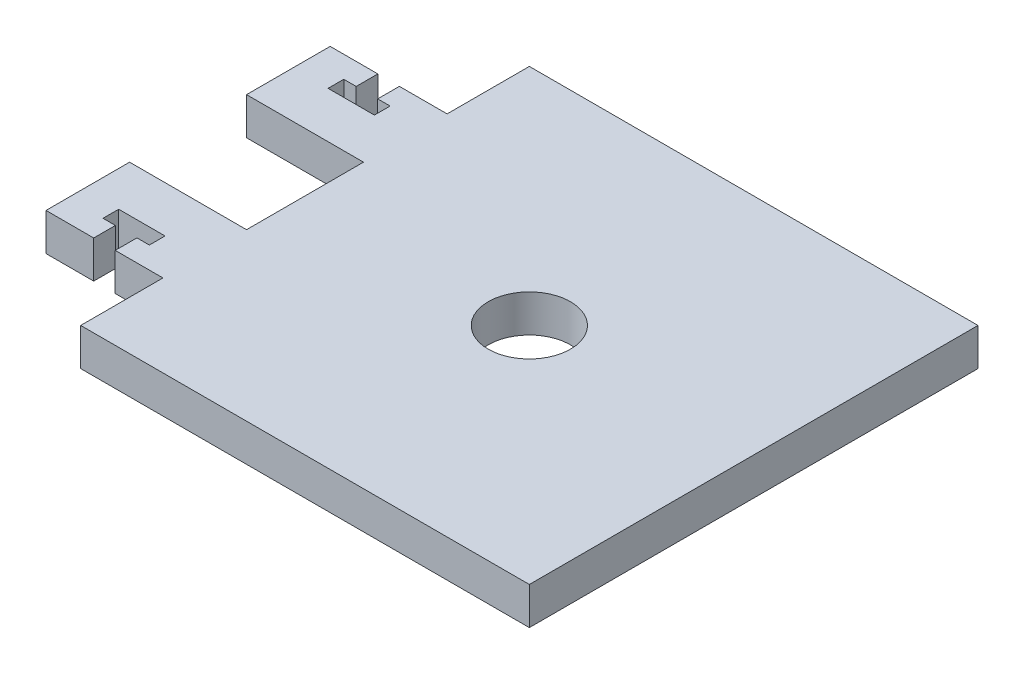
ISO-10303-21;
HEADER;
FILE_DESCRIPTION(('STEP AP214'),'2;1');
FILE_NAME('part.step','',(''),(''),'','','');
FILE_SCHEMA(('AUTOMOTIVE_DESIGN { 1 0 10303 214 1 1 1 1 }'));
ENDSEC;
DATA;
#1=APPLICATION_CONTEXT('core data for automotive mechanical design processes');
#2=APPLICATION_PROTOCOL_DEFINITION('international standard','automotive_design',2000,#1);
#3=PRODUCT_CONTEXT('',#1,'mechanical');
#4=PRODUCT('Part','Part','',(#3));
#5=PRODUCT_RELATED_PRODUCT_CATEGORY('part','',(#4));
#6=PRODUCT_DEFINITION_FORMATION('','',#4);
#7=PRODUCT_DEFINITION_CONTEXT('part definition',#1,'design');
#8=PRODUCT_DEFINITION('design','',#6,#7);
#9=PRODUCT_DEFINITION_SHAPE('','',#8);
#10=(LENGTH_UNIT() NAMED_UNIT(*) SI_UNIT(.MILLI.,.METRE.));
#11=(NAMED_UNIT(*) PLANE_ANGLE_UNIT() SI_UNIT($,.RADIAN.));
#12=(NAMED_UNIT(*) SI_UNIT($,.STERADIAN.) SOLID_ANGLE_UNIT());
#13=UNCERTAINTY_MEASURE_WITH_UNIT(LENGTH_MEASURE(1.E-05),#10,'distance_accuracy_value','');
#14=(GEOMETRIC_REPRESENTATION_CONTEXT(3) GLOBAL_UNCERTAINTY_ASSIGNED_CONTEXT((#13)) GLOBAL_UNIT_ASSIGNED_CONTEXT((#10,
#11,#12)) REPRESENTATION_CONTEXT('',''));
#15=CARTESIAN_POINT('',(0.,0.,0.));
#16=DIRECTION('',(0.,0.,1.));
#17=DIRECTION('',(1.,0.,0.));
#18=AXIS2_PLACEMENT_3D('',#15,#16,#17);
#19=CARTESIAN_POINT('',(38.1000000000002,-6.35,38.1000000000002));
#20=DIRECTION('',(1.,0.,0.));
#21=DIRECTION('',(0.,0.,-1.));
#22=AXIS2_PLACEMENT_3D('',#19,#20,#21);
#23=PLANE('',#22);
#24=DIRECTION('',(0.,0.,-1.));
#25=VECTOR('',#24,1.);
#26=CARTESIAN_POINT('',(38.1000000000002,0.,38.1000000000002));
#27=LINE('',#26,#25);
#28=CARTESIAN_POINT('',(38.1000000000002,0.,38.1000000000002));
#29=VERTEX_POINT('',#28);
#30=CARTESIAN_POINT('',(38.1000000000002,0.,-38.1000000000002));
#31=VERTEX_POINT('',#30);
#32=EDGE_CURVE('E251',#29,#31,#27,.T.);
#33=ORIENTED_EDGE('',*,*,#32,.F.);
#34=DIRECTION('',(0.,1.,0.));
#35=VECTOR('',#34,1.);
#36=CARTESIAN_POINT('',(38.1000000000002,-6.35,38.1000000000002));
#37=LINE('',#36,#35);
#38=CARTESIAN_POINT('',(38.1000000000002,-6.35,38.1000000000002));
#39=VERTEX_POINT('',#38);
#40=EDGE_CURVE('E11',#39,#29,#37,.T.);
#41=ORIENTED_EDGE('',*,*,#40,.F.);
#42=DIRECTION('',(0.,0.,-1.));
#43=VECTOR('',#42,1.);
#44=CARTESIAN_POINT('',(38.1000000000002,-6.35,38.1000000000002));
#45=LINE('',#44,#43);
#46=CARTESIAN_POINT('',(38.1000000000002,-6.35,-38.1000000000002));
#47=VERTEX_POINT('',#46);
#48=EDGE_CURVE('E332',#39,#47,#45,.T.);
#49=ORIENTED_EDGE('',*,*,#48,.T.);
#50=DIRECTION('',(0.,1.,0.));
#51=VECTOR('',#50,1.);
#52=CARTESIAN_POINT('',(38.1000000000002,-6.35,-38.1000000000002));
#53=LINE('',#52,#51);
#54=EDGE_CURVE('E37',#47,#31,#53,.T.);
#55=ORIENTED_EDGE('',*,*,#54,.T.);
#56=EDGE_LOOP('',(#33,#41,#49,#55));
#57=FACE_BOUND('',#56,.T.);
#58=ADVANCED_FACE('F34',(#57),#23,.T.);
#59=CARTESIAN_POINT('',(-38.0999999999998,-6.35,38.1000000000002));
#60=DIRECTION('',(0.,0.,1.));
#61=DIRECTION('',(1.,0.,0.));
#62=AXIS2_PLACEMENT_3D('',#59,#60,#61);
#63=PLANE('',#62);
#64=DIRECTION('',(1.,0.,0.));
#65=VECTOR('',#64,1.);
#66=CARTESIAN_POINT('',(-38.0999999999998,0.,38.1000000000002));
#67=LINE('',#66,#65);
#68=CARTESIAN_POINT('',(-38.0999999999998,0.,38.1000000000002));
#69=VERTEX_POINT('',#68);
#70=EDGE_CURVE('E330',#69,#29,#67,.T.);
#71=ORIENTED_EDGE('',*,*,#70,.F.);
#72=DIRECTION('',(0.,1.,0.));
#73=VECTOR('',#72,1.);
#74=CARTESIAN_POINT('',(-38.0999999999998,-6.35,38.1000000000002));
#75=LINE('',#74,#73);
#76=CARTESIAN_POINT('',(-38.0999999999998,-6.35,38.1000000000002));
#77=VERTEX_POINT('',#76);
#78=EDGE_CURVE('E43',#77,#69,#75,.T.);
#79=ORIENTED_EDGE('',*,*,#78,.F.);
#80=DIRECTION('',(1.,0.,0.));
#81=VECTOR('',#80,1.);
#82=CARTESIAN_POINT('',(-38.0999999999998,-6.35,38.1000000000002));
#83=LINE('',#82,#81);
#84=EDGE_CURVE('E241',#77,#39,#83,.T.);
#85=ORIENTED_EDGE('',*,*,#84,.T.);
#86=ORIENTED_EDGE('',*,*,#40,.T.);
#87=EDGE_LOOP('',(#71,#79,#85,#86));
#88=FACE_BOUND('',#87,.T.);
#89=ADVANCED_FACE('F384',(#88),#63,.T.);
#90=CARTESIAN_POINT('',(-38.0999999999998,-6.35,38.1000000000002));
#91=DIRECTION('',(-1.,0.,0.));
#92=DIRECTION('',(0.,0.,1.));
#93=AXIS2_PLACEMENT_3D('',#90,#91,#92);
#94=PLANE('',#93);
#95=DIRECTION('',(0.,0.,1.));
#96=VECTOR('',#95,1.);
#97=CARTESIAN_POINT('',(-38.0999999999998,0.,38.1000000000002));
#98=LINE('',#97,#96);
#99=CARTESIAN_POINT('',(-38.0999999999998,0.,24.1300000000002));
#100=VERTEX_POINT('',#99);
#101=EDGE_CURVE('E228',#100,#69,#98,.T.);
#102=ORIENTED_EDGE('',*,*,#101,.F.);
#103=DIRECTION('',(0.,1.,0.));
#104=VECTOR('',#103,1.);
#105=CARTESIAN_POINT('',(-38.0999999999998,-6.35,24.1300000000002));
#106=LINE('',#105,#104);
#107=CARTESIAN_POINT('',(-38.0999999999998,-6.35,24.1300000000002));
#108=VERTEX_POINT('',#107);
#109=EDGE_CURVE('E223',#108,#100,#106,.T.);
#110=ORIENTED_EDGE('',*,*,#109,.F.);
#111=DIRECTION('',(0.,0.,1.));
#112=VECTOR('',#111,1.);
#113=CARTESIAN_POINT('',(-38.0999999999998,-6.35,38.1000000000002));
#114=LINE('',#113,#112);
#115=EDGE_CURVE('E226',#108,#77,#114,.T.);
#116=ORIENTED_EDGE('',*,*,#115,.T.);
#117=ORIENTED_EDGE('',*,*,#78,.T.);
#118=EDGE_LOOP('',(#102,#110,#116,#117));
#119=FACE_BOUND('',#118,.T.);
#120=ADVANCED_FACE('F225',(#119),#94,.T.);
#121=CARTESIAN_POINT('',(-38.0999999999998,-6.35,24.1300000000002));
#122=DIRECTION('',(0.,0.,1.));
#123=DIRECTION('',(1.,0.,0.));
#124=AXIS2_PLACEMENT_3D('',#121,#122,#123);
#125=PLANE('',#124);
#126=DIRECTION('',(1.,0.,0.));
#127=VECTOR('',#126,1.);
#128=CARTESIAN_POINT('',(-38.0999999999998,0.,24.1300000000002));
#129=LINE('',#128,#127);
#130=CARTESIAN_POINT('',(-46.2025999999998,0.,24.1300000000001));
#131=VERTEX_POINT('',#130);
#132=EDGE_CURVE('E327',#131,#100,#129,.T.);
#133=ORIENTED_EDGE('',*,*,#132,.F.);
#134=DIRECTION('',(0.,1.,0.));
#135=VECTOR('',#134,1.);
#136=CARTESIAN_POINT('',(-46.2025999999998,-6.35,24.1300000000001));
#137=LINE('',#136,#135);
#138=CARTESIAN_POINT('',(-46.2025999999998,-6.35,24.1300000000001));
#139=VERTEX_POINT('',#138);
#140=EDGE_CURVE('E233',#139,#131,#137,.T.);
#141=ORIENTED_EDGE('',*,*,#140,.F.);
#142=DIRECTION('',(1.,0.,0.));
#143=VECTOR('',#142,1.);
#144=CARTESIAN_POINT('',(-38.0999999999998,-6.35,24.1300000000002));
#145=LINE('',#144,#143);
#146=EDGE_CURVE('E239',#139,#108,#145,.T.);
#147=ORIENTED_EDGE('',*,*,#146,.T.);
#148=ORIENTED_EDGE('',*,*,#109,.T.);
#149=EDGE_LOOP('',(#133,#141,#147,#148));
#150=FACE_BOUND('',#149,.T.);
#151=ADVANCED_FACE('F243',(#150),#125,.T.);
#152=CARTESIAN_POINT('',(-46.2025999999998,-6.35,24.1300000000001));
#153=DIRECTION('',(-1.,0.,0.));
#154=DIRECTION('',(0.,0.,1.));
#155=AXIS2_PLACEMENT_3D('',#152,#153,#154);
#156=PLANE('',#155);
#157=DIRECTION('',(0.,0.,1.));
#158=VECTOR('',#157,1.);
#159=CARTESIAN_POINT('',(-46.2025999999998,0.,24.1300000000001));
#160=LINE('',#159,#158);
#161=CARTESIAN_POINT('',(-46.2025999999998,0.,20.4470000000001));
#162=VERTEX_POINT('',#161);
#163=EDGE_CURVE('E324',#162,#131,#160,.T.);
#164=ORIENTED_EDGE('',*,*,#163,.F.);
#165=DIRECTION('',(0.,1.,0.));
#166=VECTOR('',#165,1.);
#167=CARTESIAN_POINT('',(-46.2025999999998,-6.35,20.4470000000001));
#168=LINE('',#167,#166);
#169=CARTESIAN_POINT('',(-46.2025999999998,-6.35,20.4470000000001));
#170=VERTEX_POINT('',#169);
#171=EDGE_CURVE('E336',#170,#162,#168,.T.);
#172=ORIENTED_EDGE('',*,*,#171,.F.);
#173=DIRECTION('',(0.,0.,1.));
#174=VECTOR('',#173,1.);
#175=CARTESIAN_POINT('',(-46.2025999999998,-6.35,24.1300000000001));
#176=LINE('',#175,#174);
#177=EDGE_CURVE('E244',#170,#139,#176,.T.);
#178=ORIENTED_EDGE('',*,*,#177,.T.);
#179=ORIENTED_EDGE('',*,*,#140,.T.);
#180=EDGE_LOOP('',(#164,#172,#178,#179));
#181=FACE_BOUND('',#180,.T.);
#182=ADVANCED_FACE('F397',(#181),#156,.T.);
#183=CARTESIAN_POINT('',(-46.2025999999998,-6.35,20.4470000000001));
#184=DIRECTION('',(0.,0.,-1.));
#185=DIRECTION('',(-1.,0.,0.));
#186=AXIS2_PLACEMENT_3D('',#183,#184,#185);
#187=PLANE('',#186);
#188=DIRECTION('',(-1.,0.,0.));
#189=VECTOR('',#188,1.);
#190=CARTESIAN_POINT('',(-46.2025999999998,0.,20.4470000000001));
#191=LINE('',#190,#189);
#192=CARTESIAN_POINT('',(-44.0943999999998,0.,20.4470000000001));
#193=VERTEX_POINT('',#192);
#194=EDGE_CURVE('E321',#193,#162,#191,.T.);
#195=ORIENTED_EDGE('',*,*,#194,.F.);
#196=DIRECTION('',(0.,1.,0.));
#197=VECTOR('',#196,1.);
#198=CARTESIAN_POINT('',(-44.0943999999998,-6.35,20.4470000000001));
#199=LINE('',#198,#197);
#200=CARTESIAN_POINT('',(-44.0943999999998,-6.35,20.4470000000001));
#201=VERTEX_POINT('',#200);
#202=EDGE_CURVE('E338',#201,#193,#199,.T.);
#203=ORIENTED_EDGE('',*,*,#202,.F.);
#204=DIRECTION('',(-1.,0.,0.));
#205=VECTOR('',#204,1.);
#206=CARTESIAN_POINT('',(-46.2025999999998,-6.35,20.4470000000001));
#207=LINE('',#206,#205);
#208=EDGE_CURVE('E246',#201,#170,#207,.T.);
#209=ORIENTED_EDGE('',*,*,#208,.T.);
#210=ORIENTED_EDGE('',*,*,#171,.T.);
#211=EDGE_LOOP('',(#195,#203,#209,#210));
#212=FACE_BOUND('',#211,.T.);
#213=ADVANCED_FACE('F400',(#212),#187,.T.);
#214=CARTESIAN_POINT('',(-44.0943999999998,-6.35,20.4470000000001));
#215=DIRECTION('',(-1.,0.,0.));
#216=DIRECTION('',(0.,0.,1.));
#217=AXIS2_PLACEMENT_3D('',#214,#215,#216);
#218=PLANE('',#217);
#219=DIRECTION('',(0.,0.,1.));
#220=VECTOR('',#219,1.);
#221=CARTESIAN_POINT('',(-44.0943999999998,0.,20.4470000000001));
#222=LINE('',#221,#220);
#223=CARTESIAN_POINT('',(-44.0943999999998,0.,17.7800000000002));
#224=VERTEX_POINT('',#223);
#225=EDGE_CURVE('E318',#224,#193,#222,.T.);
#226=ORIENTED_EDGE('',*,*,#225,.F.);
#227=DIRECTION('',(0.,1.,0.));
#228=VECTOR('',#227,1.);
#229=CARTESIAN_POINT('',(-44.0943999999998,-6.35,17.7800000000002));
#230=LINE('',#229,#228);
#231=CARTESIAN_POINT('',(-44.0943999999998,-6.35,17.7800000000002));
#232=VERTEX_POINT('',#231);
#233=EDGE_CURVE('E340',#232,#224,#230,.T.);
#234=ORIENTED_EDGE('',*,*,#233,.F.);
#235=DIRECTION('',(0.,0.,1.));
#236=VECTOR('',#235,1.);
#237=CARTESIAN_POINT('',(-44.0943999999998,-6.35,20.4470000000001));
#238=LINE('',#237,#236);
#239=EDGE_CURVE('E575',#232,#201,#238,.T.);
#240=ORIENTED_EDGE('',*,*,#239,.T.);
#241=ORIENTED_EDGE('',*,*,#202,.T.);
#242=EDGE_LOOP('',(#226,#234,#240,#241));
#243=FACE_BOUND('',#242,.T.);
#244=ADVANCED_FACE('F404',(#243),#218,.T.);
#245=CARTESIAN_POINT('',(-44.0943999999998,-6.35,17.7800000000002));
#246=DIRECTION('',(0.,0.,1.));
#247=DIRECTION('',(1.,0.,0.));
#248=AXIS2_PLACEMENT_3D('',#245,#246,#247);
#249=PLANE('',#248);
#250=DIRECTION('',(1.,0.,0.));
#251=VECTOR('',#250,1.);
#252=CARTESIAN_POINT('',(-44.0943999999998,0.,17.7800000000002));
#253=LINE('',#252,#251);
#254=CARTESIAN_POINT('',(-51.9683999999998,0.,17.7800000000002));
#255=VERTEX_POINT('',#254);
#256=EDGE_CURVE('E315',#255,#224,#253,.T.);
#257=ORIENTED_EDGE('',*,*,#256,.F.);
#258=DIRECTION('',(0.,1.,0.));
#259=VECTOR('',#258,1.);
#260=CARTESIAN_POINT('',(-51.9683999999998,-6.35,17.7800000000002));
#261=LINE('',#260,#259);
#262=CARTESIAN_POINT('',(-51.9683999999998,-6.35,17.7800000000002));
#263=VERTEX_POINT('',#262);
#264=EDGE_CURVE('E342',#263,#255,#261,.T.);
#265=ORIENTED_EDGE('',*,*,#264,.F.);
#266=DIRECTION('',(1.,0.,0.));
#267=VECTOR('',#266,1.);
#268=CARTESIAN_POINT('',(-44.0943999999998,-6.35,17.7800000000002));
#269=LINE('',#268,#267);
#270=EDGE_CURVE('E572',#263,#232,#269,.T.);
#271=ORIENTED_EDGE('',*,*,#270,.T.);
#272=ORIENTED_EDGE('',*,*,#233,.T.);
#273=EDGE_LOOP('',(#257,#265,#271,#272));
#274=FACE_BOUND('',#273,.T.);
#275=ADVANCED_FACE('F408',(#274),#249,.T.);
#276=CARTESIAN_POINT('',(-51.9683999999998,-6.35,20.4470000000001));
#277=DIRECTION('',(1.,0.,0.));
#278=DIRECTION('',(0.,0.,-1.));
#279=AXIS2_PLACEMENT_3D('',#276,#277,#278);
#280=PLANE('',#279);
#281=DIRECTION('',(0.,0.,-1.));
#282=VECTOR('',#281,1.);
#283=CARTESIAN_POINT('',(-51.9683999999998,0.,20.4470000000001));
#284=LINE('',#283,#282);
#285=CARTESIAN_POINT('',(-51.9683999999998,0.,20.4470000000001));
#286=VERTEX_POINT('',#285);
#287=EDGE_CURVE('E312',#286,#255,#284,.T.);
#288=ORIENTED_EDGE('',*,*,#287,.F.);
#289=DIRECTION('',(0.,1.,0.));
#290=VECTOR('',#289,1.);
#291=CARTESIAN_POINT('',(-51.9683999999998,-6.35,20.4470000000001));
#292=LINE('',#291,#290);
#293=CARTESIAN_POINT('',(-51.9683999999998,-6.35,20.4470000000001));
#294=VERTEX_POINT('',#293);
#295=EDGE_CURVE('E344',#294,#286,#292,.T.);
#296=ORIENTED_EDGE('',*,*,#295,.F.);
#297=DIRECTION('',(0.,0.,-1.));
#298=VECTOR('',#297,1.);
#299=CARTESIAN_POINT('',(-51.9683999999998,-6.35,20.4470000000001));
#300=LINE('',#299,#298);
#301=EDGE_CURVE('E569',#294,#263,#300,.T.);
#302=ORIENTED_EDGE('',*,*,#301,.T.);
#303=ORIENTED_EDGE('',*,*,#264,.T.);
#304=EDGE_LOOP('',(#288,#296,#302,#303));
#305=FACE_BOUND('',#304,.T.);
#306=ADVANCED_FACE('F412',(#305),#280,.T.);
#307=CARTESIAN_POINT('',(-49.8601999999998,-6.35,20.4470000000001));
#308=DIRECTION('',(0.,0.,-1.));
#309=DIRECTION('',(-1.,0.,0.));
#310=AXIS2_PLACEMENT_3D('',#307,#308,#309);
#311=PLANE('',#310);
#312=DIRECTION('',(-1.,0.,0.));
#313=VECTOR('',#312,1.);
#314=CARTESIAN_POINT('',(-49.8601999999998,0.,20.4470000000001));
#315=LINE('',#314,#313);
#316=CARTESIAN_POINT('',(-49.8601999999998,0.,20.4470000000001));
#317=VERTEX_POINT('',#316);
#318=EDGE_CURVE('E309',#317,#286,#315,.T.);
#319=ORIENTED_EDGE('',*,*,#318,.F.);
#320=DIRECTION('',(0.,1.,0.));
#321=VECTOR('',#320,1.);
#322=CARTESIAN_POINT('',(-49.8601999999998,-6.35,20.4470000000001));
#323=LINE('',#322,#321);
#324=CARTESIAN_POINT('',(-49.8601999999998,-6.35,20.4470000000001));
#325=VERTEX_POINT('',#324);
#326=EDGE_CURVE('E346',#325,#317,#323,.T.);
#327=ORIENTED_EDGE('',*,*,#326,.F.);
#328=DIRECTION('',(-1.,0.,0.));
#329=VECTOR('',#328,1.);
#330=CARTESIAN_POINT('',(-49.8601999999998,-6.35,20.4470000000001));
#331=LINE('',#330,#329);
#332=EDGE_CURVE('E566',#325,#294,#331,.T.);
#333=ORIENTED_EDGE('',*,*,#332,.T.);
#334=ORIENTED_EDGE('',*,*,#295,.T.);
#335=EDGE_LOOP('',(#319,#327,#333,#334));
#336=FACE_BOUND('',#335,.T.);
#337=ADVANCED_FACE('F416',(#336),#311,.T.);
#338=CARTESIAN_POINT('',(-49.8601999999998,-6.35,24.1300000000001));
#339=DIRECTION('',(1.,0.,0.));
#340=DIRECTION('',(0.,0.,-1.));
#341=AXIS2_PLACEMENT_3D('',#338,#339,#340);
#342=PLANE('',#341);
#343=DIRECTION('',(0.,0.,-1.));
#344=VECTOR('',#343,1.);
#345=CARTESIAN_POINT('',(-49.8601999999998,0.,24.1300000000001));
#346=LINE('',#345,#344);
#347=CARTESIAN_POINT('',(-49.8601999999998,0.,24.1300000000001));
#348=VERTEX_POINT('',#347);
#349=EDGE_CURVE('E306',#348,#317,#346,.T.);
#350=ORIENTED_EDGE('',*,*,#349,.F.);
#351=DIRECTION('',(0.,1.,0.));
#352=VECTOR('',#351,1.);
#353=CARTESIAN_POINT('',(-49.8601999999998,-6.35,24.1300000000001));
#354=LINE('',#353,#352);
#355=CARTESIAN_POINT('',(-49.8601999999998,-6.35,24.1300000000001));
#356=VERTEX_POINT('',#355);
#357=EDGE_CURVE('E348',#356,#348,#354,.T.);
#358=ORIENTED_EDGE('',*,*,#357,.F.);
#359=DIRECTION('',(0.,0.,-1.));
#360=VECTOR('',#359,1.);
#361=CARTESIAN_POINT('',(-49.8601999999998,-6.35,24.1300000000001));
#362=LINE('',#361,#360);
#363=EDGE_CURVE('E563',#356,#325,#362,.T.);
#364=ORIENTED_EDGE('',*,*,#363,.T.);
#365=ORIENTED_EDGE('',*,*,#326,.T.);
#366=EDGE_LOOP('',(#350,#358,#364,#365));
#367=FACE_BOUND('',#366,.T.);
#368=ADVANCED_FACE('F420',(#367),#342,.T.);
#369=CARTESIAN_POINT('',(-49.8601999999998,-6.35,24.1300000000001));
#370=DIRECTION('',(0.,0.,1.));
#371=DIRECTION('',(1.,0.,0.));
#372=AXIS2_PLACEMENT_3D('',#369,#370,#371);
#373=PLANE('',#372);
#374=DIRECTION('',(1.,0.,0.));
#375=VECTOR('',#374,1.);
#376=CARTESIAN_POINT('',(-49.8601999999998,0.,24.1300000000001));
#377=LINE('',#376,#375);
#378=CARTESIAN_POINT('',(-57.9627999999998,0.,24.1300000000002));
#379=VERTEX_POINT('',#378);
#380=EDGE_CURVE('E303',#379,#348,#377,.T.);
#381=ORIENTED_EDGE('',*,*,#380,.F.);
#382=DIRECTION('',(0.,1.,0.));
#383=VECTOR('',#382,1.);
#384=CARTESIAN_POINT('',(-57.9627999999998,-6.35,24.1300000000002));
#385=LINE('',#384,#383);
#386=CARTESIAN_POINT('',(-57.9627999999998,-6.35,24.1300000000002));
#387=VERTEX_POINT('',#386);
#388=EDGE_CURVE('E350',#387,#379,#385,.T.);
#389=ORIENTED_EDGE('',*,*,#388,.F.);
#390=DIRECTION('',(1.,0.,0.));
#391=VECTOR('',#390,1.);
#392=CARTESIAN_POINT('',(-49.8601999999998,-6.35,24.1300000000001));
#393=LINE('',#392,#391);
#394=EDGE_CURVE('E560',#387,#356,#393,.T.);
#395=ORIENTED_EDGE('',*,*,#394,.T.);
#396=ORIENTED_EDGE('',*,*,#357,.T.);
#397=EDGE_LOOP('',(#381,#389,#395,#396));
#398=FACE_BOUND('',#397,.T.);
#399=ADVANCED_FACE('F424',(#398),#373,.T.);
#400=CARTESIAN_POINT('',(-57.9627999999998,-6.35,24.1300000000002));
#401=DIRECTION('',(-1.,0.,0.));
#402=DIRECTION('',(0.,0.,1.));
#403=AXIS2_PLACEMENT_3D('',#400,#401,#402);
#404=PLANE('',#403);
#405=DIRECTION('',(0.,0.,1.));
#406=VECTOR('',#405,1.);
#407=CARTESIAN_POINT('',(-57.9627999999998,0.,24.1300000000002));
#408=LINE('',#407,#406);
#409=CARTESIAN_POINT('',(-57.9627999999998,0.,9.93140000000015));
#410=VERTEX_POINT('',#409);
#411=EDGE_CURVE('E300',#410,#379,#408,.T.);
#412=ORIENTED_EDGE('',*,*,#411,.F.);
#413=DIRECTION('',(0.,1.,0.));
#414=VECTOR('',#413,1.);
#415=CARTESIAN_POINT('',(-57.9627999999998,-6.35,9.93140000000015));
#416=LINE('',#415,#414);
#417=CARTESIAN_POINT('',(-57.9627999999998,-6.35,9.93140000000015));
#418=VERTEX_POINT('',#417);
#419=EDGE_CURVE('E352',#418,#410,#416,.T.);
#420=ORIENTED_EDGE('',*,*,#419,.F.);
#421=DIRECTION('',(0.,0.,1.));
#422=VECTOR('',#421,1.);
#423=CARTESIAN_POINT('',(-57.9627999999998,-6.35,24.1300000000002));
#424=LINE('',#423,#422);
#425=EDGE_CURVE('E557',#418,#387,#424,.T.);
#426=ORIENTED_EDGE('',*,*,#425,.T.);
#427=ORIENTED_EDGE('',*,*,#388,.T.);
#428=EDGE_LOOP('',(#412,#420,#426,#427));
#429=FACE_BOUND('',#428,.T.);
#430=ADVANCED_FACE('F428',(#429),#404,.T.);
#431=CARTESIAN_POINT('',(-57.9627999999998,-6.35,9.93140000000015));
#432=DIRECTION('',(0.,0.,-1.));
#433=DIRECTION('',(-1.,0.,0.));
#434=AXIS2_PLACEMENT_3D('',#431,#432,#433);
#435=PLANE('',#434);
#436=DIRECTION('',(-1.,0.,0.));
#437=VECTOR('',#436,1.);
#438=CARTESIAN_POINT('',(-57.9627999999998,0.,9.93140000000015));
#439=LINE('',#438,#437);
#440=CARTESIAN_POINT('',(-38.0999999999998,0.,9.93140000000015));
#441=VERTEX_POINT('',#440);
#442=EDGE_CURVE('E297',#441,#410,#439,.T.);
#443=ORIENTED_EDGE('',*,*,#442,.F.);
#444=DIRECTION('',(0.,1.,0.));
#445=VECTOR('',#444,1.);
#446=CARTESIAN_POINT('',(-38.0999999999998,-6.35,9.93140000000015));
#447=LINE('',#446,#445);
#448=CARTESIAN_POINT('',(-38.0999999999998,-6.35,9.93140000000015));
#449=VERTEX_POINT('',#448);
#450=EDGE_CURVE('E354',#449,#441,#447,.T.);
#451=ORIENTED_EDGE('',*,*,#450,.F.);
#452=DIRECTION('',(-1.,0.,0.));
#453=VECTOR('',#452,1.);
#454=CARTESIAN_POINT('',(-57.9627999999998,-6.35,9.93140000000015));
#455=LINE('',#454,#453);
#456=EDGE_CURVE('E554',#449,#418,#455,.T.);
#457=ORIENTED_EDGE('',*,*,#456,.T.);
#458=ORIENTED_EDGE('',*,*,#419,.T.);
#459=EDGE_LOOP('',(#443,#451,#457,#458));
#460=FACE_BOUND('',#459,.T.);
#461=ADVANCED_FACE('F432',(#460),#435,.T.);
#462=CARTESIAN_POINT('',(-38.0999999999998,-6.35,9.93140000000015));
#463=DIRECTION('',(-1.,0.,0.));
#464=DIRECTION('',(0.,0.,1.));
#465=AXIS2_PLACEMENT_3D('',#462,#463,#464);
#466=PLANE('',#465);
#467=DIRECTION('',(0.,0.,1.));
#468=VECTOR('',#467,1.);
#469=CARTESIAN_POINT('',(-38.0999999999998,0.,9.93140000000015));
#470=LINE('',#469,#468);
#471=CARTESIAN_POINT('',(-38.0999999999998,0.,-9.93140000000021));
#472=VERTEX_POINT('',#471);
#473=EDGE_CURVE('E294',#472,#441,#470,.T.);
#474=ORIENTED_EDGE('',*,*,#473,.F.);
#475=DIRECTION('',(0.,1.,0.));
#476=VECTOR('',#475,1.);
#477=CARTESIAN_POINT('',(-38.0999999999998,-6.35,-9.93140000000021));
#478=LINE('',#477,#476);
#479=CARTESIAN_POINT('',(-38.0999999999998,-6.35,-9.93140000000021));
#480=VERTEX_POINT('',#479);
#481=EDGE_CURVE('E356',#480,#472,#478,.T.);
#482=ORIENTED_EDGE('',*,*,#481,.F.);
#483=DIRECTION('',(0.,0.,1.));
#484=VECTOR('',#483,1.);
#485=CARTESIAN_POINT('',(-38.0999999999998,-6.35,9.93140000000015));
#486=LINE('',#485,#484);
#487=EDGE_CURVE('E551',#480,#449,#486,.T.);
#488=ORIENTED_EDGE('',*,*,#487,.T.);
#489=ORIENTED_EDGE('',*,*,#450,.T.);
#490=EDGE_LOOP('',(#474,#482,#488,#489));
#491=FACE_BOUND('',#490,.T.);
#492=ADVANCED_FACE('F436',(#491),#466,.T.);
#493=CARTESIAN_POINT('',(-57.9627999999998,-6.35,-9.93140000000022));
#494=DIRECTION('',(0.,0.,1.));
#495=DIRECTION('',(1.,0.,0.));
#496=AXIS2_PLACEMENT_3D('',#493,#494,#495);
#497=PLANE('',#496);
#498=DIRECTION('',(1.,0.,0.));
#499=VECTOR('',#498,1.);
#500=CARTESIAN_POINT('',(-57.9627999999998,0.,-9.93140000000022));
#501=LINE('',#500,#499);
#502=CARTESIAN_POINT('',(-57.9627999999998,0.,-9.93140000000022));
#503=VERTEX_POINT('',#502);
#504=EDGE_CURVE('E291',#503,#472,#501,.T.);
#505=ORIENTED_EDGE('',*,*,#504,.F.);
#506=DIRECTION('',(0.,1.,0.));
#507=VECTOR('',#506,1.);
#508=CARTESIAN_POINT('',(-57.9627999999998,-6.35,-9.93140000000022));
#509=LINE('',#508,#507);
#510=CARTESIAN_POINT('',(-57.9627999999998,-6.35,-9.93140000000022));
#511=VERTEX_POINT('',#510);
#512=EDGE_CURVE('E358',#511,#503,#509,.T.);
#513=ORIENTED_EDGE('',*,*,#512,.F.);
#514=DIRECTION('',(1.,0.,0.));
#515=VECTOR('',#514,1.);
#516=CARTESIAN_POINT('',(-57.9627999999998,-6.35,-9.93140000000022));
#517=LINE('',#516,#515);
#518=EDGE_CURVE('E548',#511,#480,#517,.T.);
#519=ORIENTED_EDGE('',*,*,#518,.T.);
#520=ORIENTED_EDGE('',*,*,#481,.T.);
#521=EDGE_LOOP('',(#505,#513,#519,#520));
#522=FACE_BOUND('',#521,.T.);
#523=ADVANCED_FACE('F440',(#522),#497,.T.);
#524=CARTESIAN_POINT('',(-57.9627999999998,-6.35,-24.1300000000002));
#525=DIRECTION('',(-1.,0.,0.));
#526=DIRECTION('',(0.,0.,1.));
#527=AXIS2_PLACEMENT_3D('',#524,#525,#526);
#528=PLANE('',#527);
#529=DIRECTION('',(0.,0.,1.));
#530=VECTOR('',#529,1.);
#531=CARTESIAN_POINT('',(-57.9627999999998,0.,-24.1300000000002));
#532=LINE('',#531,#530);
#533=CARTESIAN_POINT('',(-57.9627999999998,0.,-24.1300000000002));
#534=VERTEX_POINT('',#533);
#535=EDGE_CURVE('E288',#534,#503,#532,.T.);
#536=ORIENTED_EDGE('',*,*,#535,.F.);
#537=DIRECTION('',(0.,1.,0.));
#538=VECTOR('',#537,1.);
#539=CARTESIAN_POINT('',(-57.9627999999998,-6.35,-24.1300000000002));
#540=LINE('',#539,#538);
#541=CARTESIAN_POINT('',(-57.9627999999998,-6.35,-24.1300000000002));
#542=VERTEX_POINT('',#541);
#543=EDGE_CURVE('E360',#542,#534,#540,.T.);
#544=ORIENTED_EDGE('',*,*,#543,.F.);
#545=DIRECTION('',(0.,0.,1.));
#546=VECTOR('',#545,1.);
#547=CARTESIAN_POINT('',(-57.9627999999998,-6.35,-24.1300000000002));
#548=LINE('',#547,#546);
#549=EDGE_CURVE('E545',#542,#511,#548,.T.);
#550=ORIENTED_EDGE('',*,*,#549,.T.);
#551=ORIENTED_EDGE('',*,*,#512,.T.);
#552=EDGE_LOOP('',(#536,#544,#550,#551));
#553=FACE_BOUND('',#552,.T.);
#554=ADVANCED_FACE('F444',(#553),#528,.T.);
#555=CARTESIAN_POINT('',(-49.8601999999998,-6.35,-24.1300000000002));
#556=DIRECTION('',(0.,0.,-1.));
#557=DIRECTION('',(-1.,0.,0.));
#558=AXIS2_PLACEMENT_3D('',#555,#556,#557);
#559=PLANE('',#558);
#560=DIRECTION('',(-1.,0.,0.));
#561=VECTOR('',#560,1.);
#562=CARTESIAN_POINT('',(-49.8601999999998,0.,-24.1300000000002));
#563=LINE('',#562,#561);
#564=CARTESIAN_POINT('',(-49.8601999999998,0.,-24.1300000000002));
#565=VERTEX_POINT('',#564);
#566=EDGE_CURVE('E285',#565,#534,#563,.T.);
#567=ORIENTED_EDGE('',*,*,#566,.F.);
#568=DIRECTION('',(0.,1.,0.));
#569=VECTOR('',#568,1.);
#570=CARTESIAN_POINT('',(-49.8601999999998,-6.35,-24.1300000000002));
#571=LINE('',#570,#569);
#572=CARTESIAN_POINT('',(-49.8601999999998,-6.35,-24.1300000000002));
#573=VERTEX_POINT('',#572);
#574=EDGE_CURVE('E362',#573,#565,#571,.T.);
#575=ORIENTED_EDGE('',*,*,#574,.F.);
#576=DIRECTION('',(-1.,0.,0.));
#577=VECTOR('',#576,1.);
#578=CARTESIAN_POINT('',(-49.8601999999998,-6.35,-24.1300000000002));
#579=LINE('',#578,#577);
#580=EDGE_CURVE('E542',#573,#542,#579,.T.);
#581=ORIENTED_EDGE('',*,*,#580,.T.);
#582=ORIENTED_EDGE('',*,*,#543,.T.);
#583=EDGE_LOOP('',(#567,#575,#581,#582));
#584=FACE_BOUND('',#583,.T.);
#585=ADVANCED_FACE('F448',(#584),#559,.T.);
#586=CARTESIAN_POINT('',(-49.8601999999998,-6.35,-24.1300000000002));
#587=DIRECTION('',(1.,0.,0.));
#588=DIRECTION('',(0.,0.,-1.));
#589=AXIS2_PLACEMENT_3D('',#586,#587,#588);
#590=PLANE('',#589);
#591=DIRECTION('',(0.,0.,-1.));
#592=VECTOR('',#591,1.);
#593=CARTESIAN_POINT('',(-49.8601999999998,0.,-24.1300000000002));
#594=LINE('',#593,#592);
#595=CARTESIAN_POINT('',(-49.8601999999998,0.,-20.4470000000002));
#596=VERTEX_POINT('',#595);
#597=EDGE_CURVE('E282',#596,#565,#594,.T.);
#598=ORIENTED_EDGE('',*,*,#597,.F.);
#599=DIRECTION('',(0.,1.,0.));
#600=VECTOR('',#599,1.);
#601=CARTESIAN_POINT('',(-49.8601999999998,-6.35,-20.4470000000002));
#602=LINE('',#601,#600);
#603=CARTESIAN_POINT('',(-49.8601999999998,-6.35,-20.4470000000002));
#604=VERTEX_POINT('',#603);
#605=EDGE_CURVE('E364',#604,#596,#602,.T.);
#606=ORIENTED_EDGE('',*,*,#605,.F.);
#607=DIRECTION('',(0.,0.,-1.));
#608=VECTOR('',#607,1.);
#609=CARTESIAN_POINT('',(-49.8601999999998,-6.35,-24.1300000000002));
#610=LINE('',#609,#608);
#611=EDGE_CURVE('E539',#604,#573,#610,.T.);
#612=ORIENTED_EDGE('',*,*,#611,.T.);
#613=ORIENTED_EDGE('',*,*,#574,.T.);
#614=EDGE_LOOP('',(#598,#606,#612,#613));
#615=FACE_BOUND('',#614,.T.);
#616=ADVANCED_FACE('F452',(#615),#590,.T.);
#617=CARTESIAN_POINT('',(-49.8601999999998,-6.35,-20.4470000000002));
#618=DIRECTION('',(0.,0.,1.));
#619=DIRECTION('',(1.,0.,0.));
#620=AXIS2_PLACEMENT_3D('',#617,#618,#619);
#621=PLANE('',#620);
#622=DIRECTION('',(1.,0.,0.));
#623=VECTOR('',#622,1.);
#624=CARTESIAN_POINT('',(-49.8601999999998,0.,-20.4470000000002));
#625=LINE('',#624,#623);
#626=CARTESIAN_POINT('',(-51.9683999999998,0.,-20.4470000000002));
#627=VERTEX_POINT('',#626);
#628=EDGE_CURVE('E279',#627,#596,#625,.T.);
#629=ORIENTED_EDGE('',*,*,#628,.F.);
#630=DIRECTION('',(0.,1.,0.));
#631=VECTOR('',#630,1.);
#632=CARTESIAN_POINT('',(-51.9683999999998,-6.35,-20.4470000000002));
#633=LINE('',#632,#631);
#634=CARTESIAN_POINT('',(-51.9683999999998,-6.35,-20.4470000000002));
#635=VERTEX_POINT('',#634);
#636=EDGE_CURVE('E366',#635,#627,#633,.T.);
#637=ORIENTED_EDGE('',*,*,#636,.F.);
#638=DIRECTION('',(1.,0.,0.));
#639=VECTOR('',#638,1.);
#640=CARTESIAN_POINT('',(-49.8601999999998,-6.35,-20.4470000000002));
#641=LINE('',#640,#639);
#642=EDGE_CURVE('E536',#635,#604,#641,.T.);
#643=ORIENTED_EDGE('',*,*,#642,.T.);
#644=ORIENTED_EDGE('',*,*,#605,.T.);
#645=EDGE_LOOP('',(#629,#637,#643,#644));
#646=FACE_BOUND('',#645,.T.);
#647=ADVANCED_FACE('F456',(#646),#621,.T.);
#648=CARTESIAN_POINT('',(-51.9683999999998,-6.35,-20.4470000000002));
#649=DIRECTION('',(1.,0.,0.));
#650=DIRECTION('',(0.,0.,-1.));
#651=AXIS2_PLACEMENT_3D('',#648,#649,#650);
#652=PLANE('',#651);
#653=DIRECTION('',(0.,0.,-1.));
#654=VECTOR('',#653,1.);
#655=CARTESIAN_POINT('',(-51.9683999999998,0.,-20.4470000000002));
#656=LINE('',#655,#654);
#657=CARTESIAN_POINT('',(-51.9683999999998,0.,-17.7800000000002));
#658=VERTEX_POINT('',#657);
#659=EDGE_CURVE('E276',#658,#627,#656,.T.);
#660=ORIENTED_EDGE('',*,*,#659,.F.);
#661=DIRECTION('',(0.,1.,0.));
#662=VECTOR('',#661,1.);
#663=CARTESIAN_POINT('',(-51.9683999999998,-6.35,-17.7800000000002));
#664=LINE('',#663,#662);
#665=CARTESIAN_POINT('',(-51.9683999999998,-6.35,-17.7800000000002));
#666=VERTEX_POINT('',#665);
#667=EDGE_CURVE('E368',#666,#658,#664,.T.);
#668=ORIENTED_EDGE('',*,*,#667,.F.);
#669=DIRECTION('',(0.,0.,-1.));
#670=VECTOR('',#669,1.);
#671=CARTESIAN_POINT('',(-51.9683999999998,-6.35,-20.4470000000002));
#672=LINE('',#671,#670);
#673=EDGE_CURVE('E533',#666,#635,#672,.T.);
#674=ORIENTED_EDGE('',*,*,#673,.T.);
#675=ORIENTED_EDGE('',*,*,#636,.T.);
#676=EDGE_LOOP('',(#660,#668,#674,#675));
#677=FACE_BOUND('',#676,.T.);
#678=ADVANCED_FACE('F460',(#677),#652,.T.);
#679=CARTESIAN_POINT('',(-44.0943999999998,-6.35,-17.7800000000002));
#680=DIRECTION('',(0.,0.,-1.));
#681=DIRECTION('',(-1.,0.,0.));
#682=AXIS2_PLACEMENT_3D('',#679,#680,#681);
#683=PLANE('',#682);
#684=DIRECTION('',(-1.,0.,0.));
#685=VECTOR('',#684,1.);
#686=CARTESIAN_POINT('',(-44.0943999999998,0.,-17.7800000000002));
#687=LINE('',#686,#685);
#688=CARTESIAN_POINT('',(-44.0943999999998,0.,-17.7800000000002));
#689=VERTEX_POINT('',#688);
#690=EDGE_CURVE('E273',#689,#658,#687,.T.);
#691=ORIENTED_EDGE('',*,*,#690,.F.);
#692=DIRECTION('',(0.,1.,0.));
#693=VECTOR('',#692,1.);
#694=CARTESIAN_POINT('',(-44.0943999999998,-6.35,-17.7800000000002));
#695=LINE('',#694,#693);
#696=CARTESIAN_POINT('',(-44.0943999999998,-6.35,-17.7800000000002));
#697=VERTEX_POINT('',#696);
#698=EDGE_CURVE('E370',#697,#689,#695,.T.);
#699=ORIENTED_EDGE('',*,*,#698,.F.);
#700=DIRECTION('',(-1.,0.,0.));
#701=VECTOR('',#700,1.);
#702=CARTESIAN_POINT('',(-44.0943999999998,-6.35,-17.7800000000002));
#703=LINE('',#702,#701);
#704=EDGE_CURVE('E530',#697,#666,#703,.T.);
#705=ORIENTED_EDGE('',*,*,#704,.T.);
#706=ORIENTED_EDGE('',*,*,#667,.T.);
#707=EDGE_LOOP('',(#691,#699,#705,#706));
#708=FACE_BOUND('',#707,.T.);
#709=ADVANCED_FACE('F464',(#708),#683,.T.);
#710=CARTESIAN_POINT('',(-44.0943999999998,-6.35,-20.4470000000002));
#711=DIRECTION('',(-1.,0.,0.));
#712=DIRECTION('',(0.,0.,1.));
#713=AXIS2_PLACEMENT_3D('',#710,#711,#712);
#714=PLANE('',#713);
#715=DIRECTION('',(0.,0.,1.));
#716=VECTOR('',#715,1.);
#717=CARTESIAN_POINT('',(-44.0943999999998,0.,-20.4470000000002));
#718=LINE('',#717,#716);
#719=CARTESIAN_POINT('',(-44.0943999999998,0.,-20.4470000000002));
#720=VERTEX_POINT('',#719);
#721=EDGE_CURVE('E270',#720,#689,#718,.T.);
#722=ORIENTED_EDGE('',*,*,#721,.F.);
#723=DIRECTION('',(0.,1.,0.));
#724=VECTOR('',#723,1.);
#725=CARTESIAN_POINT('',(-44.0943999999998,-6.35,-20.4470000000002));
#726=LINE('',#725,#724);
#727=CARTESIAN_POINT('',(-44.0943999999998,-6.35,-20.4470000000002));
#728=VERTEX_POINT('',#727);
#729=EDGE_CURVE('E372',#728,#720,#726,.T.);
#730=ORIENTED_EDGE('',*,*,#729,.F.);
#731=DIRECTION('',(0.,0.,1.));
#732=VECTOR('',#731,1.);
#733=CARTESIAN_POINT('',(-44.0943999999998,-6.35,-20.4470000000002));
#734=LINE('',#733,#732);
#735=EDGE_CURVE('E527',#728,#697,#734,.T.);
#736=ORIENTED_EDGE('',*,*,#735,.T.);
#737=ORIENTED_EDGE('',*,*,#698,.T.);
#738=EDGE_LOOP('',(#722,#730,#736,#737));
#739=FACE_BOUND('',#738,.T.);
#740=ADVANCED_FACE('F468',(#739),#714,.T.);
#741=CARTESIAN_POINT('',(-46.2025999999998,-6.35,-20.4470000000002));
#742=DIRECTION('',(0.,0.,1.));
#743=DIRECTION('',(1.,0.,0.));
#744=AXIS2_PLACEMENT_3D('',#741,#742,#743);
#745=PLANE('',#744);
#746=DIRECTION('',(1.,0.,0.));
#747=VECTOR('',#746,1.);
#748=CARTESIAN_POINT('',(-46.2025999999998,0.,-20.4470000000002));
#749=LINE('',#748,#747);
#750=CARTESIAN_POINT('',(-46.2025999999998,0.,-20.4470000000002));
#751=VERTEX_POINT('',#750);
#752=EDGE_CURVE('E267',#751,#720,#749,.T.);
#753=ORIENTED_EDGE('',*,*,#752,.F.);
#754=DIRECTION('',(0.,1.,0.));
#755=VECTOR('',#754,1.);
#756=CARTESIAN_POINT('',(-46.2025999999998,-6.35,-20.4470000000002));
#757=LINE('',#756,#755);
#758=CARTESIAN_POINT('',(-46.2025999999998,-6.35,-20.4470000000002));
#759=VERTEX_POINT('',#758);
#760=EDGE_CURVE('E374',#759,#751,#757,.T.);
#761=ORIENTED_EDGE('',*,*,#760,.F.);
#762=DIRECTION('',(1.,0.,0.));
#763=VECTOR('',#762,1.);
#764=CARTESIAN_POINT('',(-46.2025999999998,-6.35,-20.4470000000002));
#765=LINE('',#764,#763);
#766=EDGE_CURVE('E524',#759,#728,#765,.T.);
#767=ORIENTED_EDGE('',*,*,#766,.T.);
#768=ORIENTED_EDGE('',*,*,#729,.T.);
#769=EDGE_LOOP('',(#753,#761,#767,#768));
#770=FACE_BOUND('',#769,.T.);
#771=ADVANCED_FACE('F472',(#770),#745,.T.);
#772=CARTESIAN_POINT('',(-46.2025999999998,-6.35,-24.1300000000002));
#773=DIRECTION('',(-1.,0.,0.));
#774=DIRECTION('',(0.,0.,1.));
#775=AXIS2_PLACEMENT_3D('',#772,#773,#774);
#776=PLANE('',#775);
#777=DIRECTION('',(0.,0.,1.));
#778=VECTOR('',#777,1.);
#779=CARTESIAN_POINT('',(-46.2025999999998,0.,-24.1300000000002));
#780=LINE('',#779,#778);
#781=CARTESIAN_POINT('',(-46.2025999999998,0.,-24.1300000000002));
#782=VERTEX_POINT('',#781);
#783=EDGE_CURVE('E264',#782,#751,#780,.T.);
#784=ORIENTED_EDGE('',*,*,#783,.F.);
#785=DIRECTION('',(0.,1.,0.));
#786=VECTOR('',#785,1.);
#787=CARTESIAN_POINT('',(-46.2025999999998,-6.35,-24.1300000000002));
#788=LINE('',#787,#786);
#789=CARTESIAN_POINT('',(-46.2025999999998,-6.35,-24.1300000000002));
#790=VERTEX_POINT('',#789);
#791=EDGE_CURVE('E376',#790,#782,#788,.T.);
#792=ORIENTED_EDGE('',*,*,#791,.F.);
#793=DIRECTION('',(0.,0.,1.));
#794=VECTOR('',#793,1.);
#795=CARTESIAN_POINT('',(-46.2025999999998,-6.35,-24.1300000000002));
#796=LINE('',#795,#794);
#797=EDGE_CURVE('E521',#790,#759,#796,.T.);
#798=ORIENTED_EDGE('',*,*,#797,.T.);
#799=ORIENTED_EDGE('',*,*,#760,.T.);
#800=EDGE_LOOP('',(#784,#792,#798,#799));
#801=FACE_BOUND('',#800,.T.);
#802=ADVANCED_FACE('F476',(#801),#776,.T.);
#803=CARTESIAN_POINT('',(-38.0999999999998,-6.35,-24.1300000000002));
#804=DIRECTION('',(0.,0.,-1.));
#805=DIRECTION('',(-1.,0.,0.));
#806=AXIS2_PLACEMENT_3D('',#803,#804,#805);
#807=PLANE('',#806);
#808=DIRECTION('',(-1.,0.,0.));
#809=VECTOR('',#808,1.);
#810=CARTESIAN_POINT('',(-38.0999999999998,0.,-24.1300000000002));
#811=LINE('',#810,#809);
#812=CARTESIAN_POINT('',(-38.0999999999998,0.,-24.1300000000002));
#813=VERTEX_POINT('',#812);
#814=EDGE_CURVE('E261',#813,#782,#811,.T.);
#815=ORIENTED_EDGE('',*,*,#814,.F.);
#816=DIRECTION('',(0.,1.,0.));
#817=VECTOR('',#816,1.);
#818=CARTESIAN_POINT('',(-38.0999999999998,-6.35,-24.1300000000002));
#819=LINE('',#818,#817);
#820=CARTESIAN_POINT('',(-38.0999999999998,-6.35,-24.1300000000002));
#821=VERTEX_POINT('',#820);
#822=EDGE_CURVE('E378',#821,#813,#819,.T.);
#823=ORIENTED_EDGE('',*,*,#822,.F.);
#824=DIRECTION('',(-1.,0.,0.));
#825=VECTOR('',#824,1.);
#826=CARTESIAN_POINT('',(-38.0999999999998,-6.35,-24.1300000000002));
#827=LINE('',#826,#825);
#828=EDGE_CURVE('E518',#821,#790,#827,.T.);
#829=ORIENTED_EDGE('',*,*,#828,.T.);
#830=ORIENTED_EDGE('',*,*,#791,.T.);
#831=EDGE_LOOP('',(#815,#823,#829,#830));
#832=FACE_BOUND('',#831,.T.);
#833=ADVANCED_FACE('F480',(#832),#807,.T.);
#834=CARTESIAN_POINT('',(-38.0999999999998,-6.35,-24.1300000000002));
#835=DIRECTION('',(-1.,0.,0.));
#836=DIRECTION('',(0.,0.,1.));
#837=AXIS2_PLACEMENT_3D('',#834,#835,#836);
#838=PLANE('',#837);
#839=DIRECTION('',(0.,0.,1.));
#840=VECTOR('',#839,1.);
#841=CARTESIAN_POINT('',(-38.0999999999998,0.,-24.1300000000002));
#842=LINE('',#841,#840);
#843=CARTESIAN_POINT('',(-38.0999999999998,0.,-38.1000000000002));
#844=VERTEX_POINT('',#843);
#845=EDGE_CURVE('E258',#844,#813,#842,.T.);
#846=ORIENTED_EDGE('',*,*,#845,.F.);
#847=DIRECTION('',(0.,1.,0.));
#848=VECTOR('',#847,1.);
#849=CARTESIAN_POINT('',(-38.0999999999998,-6.35,-38.1000000000002));
#850=LINE('',#849,#848);
#851=CARTESIAN_POINT('',(-38.0999999999998,-6.35,-38.1000000000002));
#852=VERTEX_POINT('',#851);
#853=EDGE_CURVE('E379',#852,#844,#850,.T.);
#854=ORIENTED_EDGE('',*,*,#853,.F.);
#855=DIRECTION('',(0.,0.,1.));
#856=VECTOR('',#855,1.);
#857=CARTESIAN_POINT('',(-38.0999999999998,-6.35,-24.1300000000002));
#858=LINE('',#857,#856);
#859=EDGE_CURVE('E515',#852,#821,#858,.T.);
#860=ORIENTED_EDGE('',*,*,#859,.T.);
#861=ORIENTED_EDGE('',*,*,#822,.T.);
#862=EDGE_LOOP('',(#846,#854,#860,#861));
#863=FACE_BOUND('',#862,.T.);
#864=ADVANCED_FACE('F484',(#863),#838,.T.);
#865=CARTESIAN_POINT('',(-38.0999999999998,-6.35,-38.1000000000002));
#866=DIRECTION('',(0.,0.,-1.));
#867=DIRECTION('',(-1.,0.,0.));
#868=AXIS2_PLACEMENT_3D('',#865,#866,#867);
#869=PLANE('',#868);
#870=DIRECTION('',(-1.,0.,0.));
#871=VECTOR('',#870,1.);
#872=CARTESIAN_POINT('',(-38.0999999999998,0.,-38.1000000000002));
#873=LINE('',#872,#871);
#874=EDGE_CURVE('E254',#31,#844,#873,.T.);
#875=ORIENTED_EDGE('',*,*,#874,.F.);
#876=ORIENTED_EDGE('',*,*,#54,.F.);
#877=DIRECTION('',(-1.,0.,0.));
#878=VECTOR('',#877,1.);
#879=CARTESIAN_POINT('',(-38.0999999999998,-6.35,-38.1000000000002));
#880=LINE('',#879,#878);
#881=EDGE_CURVE('E513',#47,#852,#880,.T.);
#882=ORIENTED_EDGE('',*,*,#881,.T.);
#883=ORIENTED_EDGE('',*,*,#853,.T.);
#884=EDGE_LOOP('',(#875,#876,#882,#883));
#885=FACE_BOUND('',#884,.T.);
#886=ADVANCED_FACE('F381',(#885),#869,.T.);
#887=CARTESIAN_POINT('',(0.,-6.35,0.));
#888=DIRECTION('',(0.,-1.,0.));
#889=DIRECTION('',(0.,0.,-1.));
#890=AXIS2_PLACEMENT_3D('',#887,#888,#889);
#891=PLANE('',#890);
#892=CARTESIAN_POINT('',(0.,-6.35,0.));
#893=DIRECTION('',(0.,1.,0.));
#894=DIRECTION('',(0.,0.,1.));
#895=AXIS2_PLACEMENT_3D('',#892,#893,#894);
#896=CIRCLE('',#895,6.985);
#897=CARTESIAN_POINT('',(0.,-6.35,6.98499999999999));
#898=VERTEX_POINT('',#897);
#899=EDGE_CURVE('E255',#898,#898,#896,.T.);
#900=ORIENTED_EDGE('',*,*,#899,.T.);
#901=EDGE_LOOP('',(#900));
#902=FACE_BOUND('',#901,.T.);
#903=ORIENTED_EDGE('',*,*,#48,.F.);
#904=ORIENTED_EDGE('',*,*,#84,.F.);
#905=ORIENTED_EDGE('',*,*,#115,.F.);
#906=ORIENTED_EDGE('',*,*,#146,.F.);
#907=ORIENTED_EDGE('',*,*,#177,.F.);
#908=ORIENTED_EDGE('',*,*,#208,.F.);
#909=ORIENTED_EDGE('',*,*,#239,.F.);
#910=ORIENTED_EDGE('',*,*,#270,.F.);
#911=ORIENTED_EDGE('',*,*,#301,.F.);
#912=ORIENTED_EDGE('',*,*,#332,.F.);
#913=ORIENTED_EDGE('',*,*,#363,.F.);
#914=ORIENTED_EDGE('',*,*,#394,.F.);
#915=ORIENTED_EDGE('',*,*,#425,.F.);
#916=ORIENTED_EDGE('',*,*,#456,.F.);
#917=ORIENTED_EDGE('',*,*,#487,.F.);
#918=ORIENTED_EDGE('',*,*,#518,.F.);
#919=ORIENTED_EDGE('',*,*,#549,.F.);
#920=ORIENTED_EDGE('',*,*,#580,.F.);
#921=ORIENTED_EDGE('',*,*,#611,.F.);
#922=ORIENTED_EDGE('',*,*,#642,.F.);
#923=ORIENTED_EDGE('',*,*,#673,.F.);
#924=ORIENTED_EDGE('',*,*,#704,.F.);
#925=ORIENTED_EDGE('',*,*,#735,.F.);
#926=ORIENTED_EDGE('',*,*,#766,.F.);
#927=ORIENTED_EDGE('',*,*,#797,.F.);
#928=ORIENTED_EDGE('',*,*,#828,.F.);
#929=ORIENTED_EDGE('',*,*,#859,.F.);
#930=ORIENTED_EDGE('',*,*,#881,.F.);
#931=EDGE_LOOP('',(#903,#904,#905,#906,#907,#908,#909,#910,#911,#912,#913,#914,#915,#916,#917,
#918,#919,#920,#921,#922,#923,#924,#925,#926,#927,#928,#929,#930));
#932=FACE_BOUND('',#931,.T.);
#933=ADVANCED_FACE('F237',(#902,#932),#891,.T.);
#934=CARTESIAN_POINT('',(0.,0.,0.));
#935=DIRECTION('',(0.,-1.,0.));
#936=DIRECTION('',(0.,0.,-1.));
#937=AXIS2_PLACEMENT_3D('',#934,#935,#936);
#938=PLANE('',#937);
#939=CARTESIAN_POINT('',(0.,0.,0.));
#940=DIRECTION('',(0.,1.,0.));
#941=DIRECTION('',(0.,0.,1.));
#942=AXIS2_PLACEMENT_3D('',#939,#940,#941);
#943=CIRCLE('',#942,6.985);
#944=CARTESIAN_POINT('',(0.,0.,6.98499999999999));
#945=VERTEX_POINT('',#944);
#946=EDGE_CURVE('E508',#945,#945,#943,.T.);
#947=ORIENTED_EDGE('',*,*,#946,.F.);
#948=EDGE_LOOP('',(#947));
#949=FACE_BOUND('',#948,.T.);
#950=ORIENTED_EDGE('',*,*,#32,.T.);
#951=ORIENTED_EDGE('',*,*,#874,.T.);
#952=ORIENTED_EDGE('',*,*,#845,.T.);
#953=ORIENTED_EDGE('',*,*,#814,.T.);
#954=ORIENTED_EDGE('',*,*,#783,.T.);
#955=ORIENTED_EDGE('',*,*,#752,.T.);
#956=ORIENTED_EDGE('',*,*,#721,.T.);
#957=ORIENTED_EDGE('',*,*,#690,.T.);
#958=ORIENTED_EDGE('',*,*,#659,.T.);
#959=ORIENTED_EDGE('',*,*,#628,.T.);
#960=ORIENTED_EDGE('',*,*,#597,.T.);
#961=ORIENTED_EDGE('',*,*,#566,.T.);
#962=ORIENTED_EDGE('',*,*,#535,.T.);
#963=ORIENTED_EDGE('',*,*,#504,.T.);
#964=ORIENTED_EDGE('',*,*,#473,.T.);
#965=ORIENTED_EDGE('',*,*,#442,.T.);
#966=ORIENTED_EDGE('',*,*,#411,.T.);
#967=ORIENTED_EDGE('',*,*,#380,.T.);
#968=ORIENTED_EDGE('',*,*,#349,.T.);
#969=ORIENTED_EDGE('',*,*,#318,.T.);
#970=ORIENTED_EDGE('',*,*,#287,.T.);
#971=ORIENTED_EDGE('',*,*,#256,.T.);
#972=ORIENTED_EDGE('',*,*,#225,.T.);
#973=ORIENTED_EDGE('',*,*,#194,.T.);
#974=ORIENTED_EDGE('',*,*,#163,.T.);
#975=ORIENTED_EDGE('',*,*,#132,.T.);
#976=ORIENTED_EDGE('',*,*,#101,.T.);
#977=ORIENTED_EDGE('',*,*,#70,.T.);
#978=EDGE_LOOP('',(#950,#951,#952,#953,#954,#955,#956,#957,#958,#959,#960,#961,#962,#963,#964,
#965,#966,#967,#968,#969,#970,#971,#972,#973,#974,#975,#976,#977));
#979=FACE_BOUND('',#978,.T.);
#980=ADVANCED_FACE('F383',(#949,#979),#938,.F.);
#981=CARTESIAN_POINT('',(0.,-6.35,0.));
#982=DIRECTION('',(0.,1.,0.));
#983=DIRECTION('',(0.,0.,1.));
#984=AXIS2_PLACEMENT_3D('',#981,#982,#983);
#985=CYLINDRICAL_SURFACE('',#984,6.985);
#986=ORIENTED_EDGE('',*,*,#899,.F.);
#987=EDGE_LOOP('',(#986));
#988=FACE_BOUND('',#987,.T.);
#989=ORIENTED_EDGE('',*,*,#946,.T.);
#990=EDGE_LOOP('',(#989));
#991=FACE_BOUND('',#990,.T.);
#992=ADVANCED_FACE('F496',(#988,#991),#985,.F.);
#993=CLOSED_SHELL('',(#58,#89,#120,#151,#182,#213,#244,#275,#306,#337,#368,#399,#430,#461,#492,
#523,#554,#585,#616,#647,#678,#709,#740,#771,#802,#833,#864,#886,#933,#980,#992));
#994=MANIFOLD_SOLID_BREP('B2',#993);
#995=ADVANCED_BREP_SHAPE_REPRESENTATION('',(#18,#994),#14);
#996=SHAPE_DEFINITION_REPRESENTATION(#9,#995);
ENDSEC;
END-ISO-10303-21;
